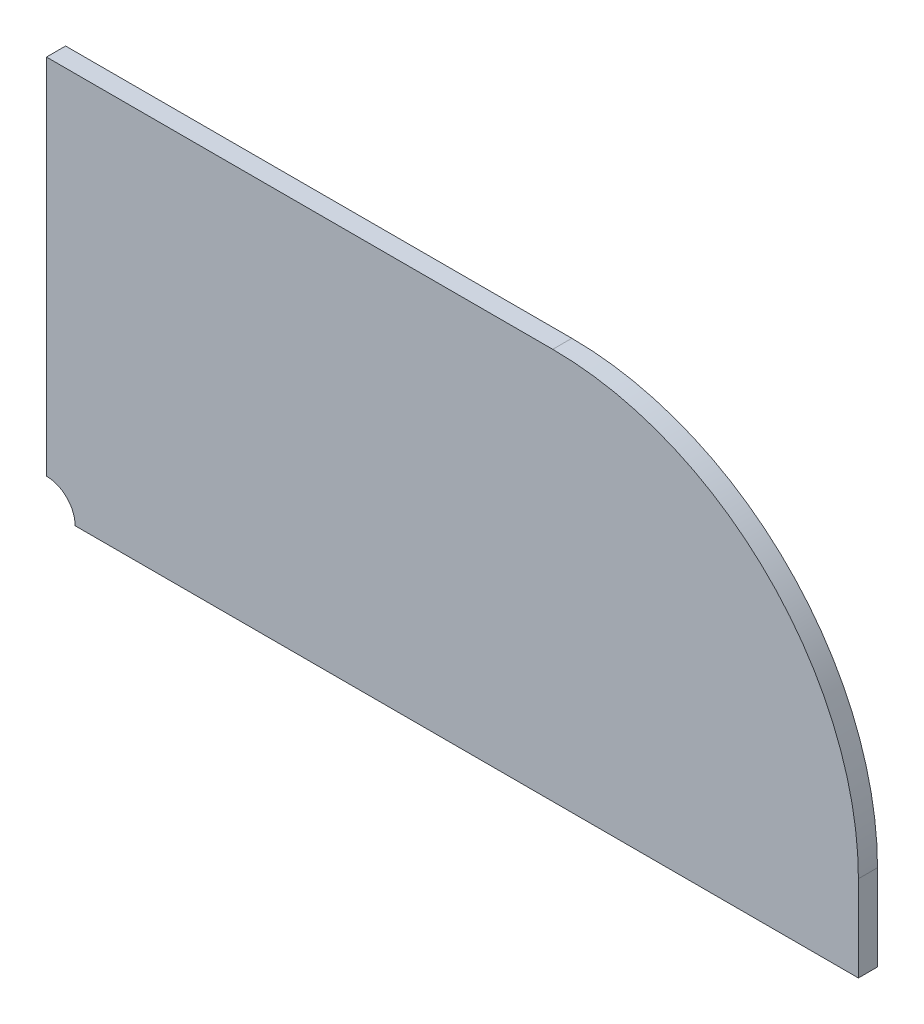
ISO-10303-21;
HEADER;
FILE_DESCRIPTION(('STEP AP214'),'2;1');
FILE_NAME('part.step','',(''),(''),'','','');
FILE_SCHEMA(('AUTOMOTIVE_DESIGN { 1 0 10303 214 1 1 1 1 }'));
ENDSEC;
DATA;
#1=APPLICATION_CONTEXT('core data for automotive mechanical design processes');
#2=APPLICATION_PROTOCOL_DEFINITION('international standard','automotive_design',2000,#1);
#3=PRODUCT_CONTEXT('',#1,'mechanical');
#4=PRODUCT('Part','Part','',(#3));
#5=PRODUCT_RELATED_PRODUCT_CATEGORY('part','',(#4));
#6=PRODUCT_DEFINITION_FORMATION('','',#4);
#7=PRODUCT_DEFINITION_CONTEXT('part definition',#1,'design');
#8=PRODUCT_DEFINITION('design','',#6,#7);
#9=PRODUCT_DEFINITION_SHAPE('','',#8);
#10=(LENGTH_UNIT() NAMED_UNIT(*) SI_UNIT(.MILLI.,.METRE.));
#11=(NAMED_UNIT(*) PLANE_ANGLE_UNIT() SI_UNIT($,.RADIAN.));
#12=(NAMED_UNIT(*) SI_UNIT($,.STERADIAN.) SOLID_ANGLE_UNIT());
#13=UNCERTAINTY_MEASURE_WITH_UNIT(LENGTH_MEASURE(1.E-05),#10,'distance_accuracy_value','');
#14=(GEOMETRIC_REPRESENTATION_CONTEXT(3) GLOBAL_UNCERTAINTY_ASSIGNED_CONTEXT((#13)) GLOBAL_UNIT_ASSIGNED_CONTEXT((#10,
#11,#12)) REPRESENTATION_CONTEXT('',''));
#15=CARTESIAN_POINT('',(0.,0.,0.));
#16=DIRECTION('',(0.,0.,1.));
#17=DIRECTION('',(1.,0.,0.));
#18=AXIS2_PLACEMENT_3D('',#15,#16,#17);
#19=CARTESIAN_POINT('',(26.5,4.5,-1.));
#20=DIRECTION('',(0.,0.,1.));
#21=DIRECTION('',(1.,0.,0.));
#22=AXIS2_PLACEMENT_3D('',#19,#20,#21);
#23=CYLINDRICAL_SURFACE('',#22,16.);
#24=CARTESIAN_POINT('',(26.5,4.5,0.));
#25=DIRECTION('',(0.,0.,1.));
#26=DIRECTION('',(1.,0.,0.));
#27=AXIS2_PLACEMENT_3D('',#24,#25,#26);
#28=CIRCLE('',#27,16.);
#29=CARTESIAN_POINT('',(42.5,4.5,0.));
#30=VERTEX_POINT('',#29);
#31=CARTESIAN_POINT('',(26.5,20.5,0.));
#32=VERTEX_POINT('',#31);
#33=EDGE_CURVE('E123',#30,#32,#28,.T.);
#34=ORIENTED_EDGE('',*,*,#33,.F.);
#35=DIRECTION('',(0.,0.,1.));
#36=VECTOR('',#35,1.);
#37=CARTESIAN_POINT('',(42.5,4.5,-1.));
#38=LINE('',#37,#36);
#39=CARTESIAN_POINT('',(42.5,4.5,-1.));
#40=VERTEX_POINT('',#39);
#41=EDGE_CURVE('E11',#40,#30,#38,.T.);
#42=ORIENTED_EDGE('',*,*,#41,.F.);
#43=CARTESIAN_POINT('',(26.5,4.5,-1.));
#44=DIRECTION('',(0.,0.,1.));
#45=DIRECTION('',(1.,0.,0.));
#46=AXIS2_PLACEMENT_3D('',#43,#44,#45);
#47=CIRCLE('',#46,16.);
#48=CARTESIAN_POINT('',(26.5,20.5,-1.));
#49=VERTEX_POINT('',#48);
#50=EDGE_CURVE('E137',#40,#49,#47,.T.);
#51=ORIENTED_EDGE('',*,*,#50,.T.);
#52=DIRECTION('',(0.,0.,1.));
#53=VECTOR('',#52,1.);
#54=CARTESIAN_POINT('',(26.5,20.5,-1.));
#55=LINE('',#54,#53);
#56=EDGE_CURVE('E41',#49,#32,#55,.T.);
#57=ORIENTED_EDGE('',*,*,#56,.T.);
#58=EDGE_LOOP('',(#34,#42,#51,#57));
#59=FACE_BOUND('',#58,.T.);
#60=ADVANCED_FACE('F38',(#59),#23,.T.);
#61=CARTESIAN_POINT('',(42.5,4.5,-1.));
#62=DIRECTION('',(1.,0.,0.));
#63=DIRECTION('',(0.,0.,-1.));
#64=AXIS2_PLACEMENT_3D('',#61,#62,#63);
#65=PLANE('',#64);
#66=DIRECTION('',(0.,1.,0.));
#67=VECTOR('',#66,1.);
#68=CARTESIAN_POINT('',(42.5,4.5,0.));
#69=LINE('',#68,#67);
#70=CARTESIAN_POINT('',(42.5,0.,0.));
#71=VERTEX_POINT('',#70);
#72=EDGE_CURVE('E135',#71,#30,#69,.T.);
#73=ORIENTED_EDGE('',*,*,#72,.F.);
#74=DIRECTION('',(0.,0.,1.));
#75=VECTOR('',#74,1.);
#76=CARTESIAN_POINT('',(42.5,0.,-1.));
#77=LINE('',#76,#75);
#78=CARTESIAN_POINT('',(42.5,0.,-1.));
#79=VERTEX_POINT('',#78);
#80=EDGE_CURVE('E47',#79,#71,#77,.T.);
#81=ORIENTED_EDGE('',*,*,#80,.F.);
#82=DIRECTION('',(0.,1.,0.));
#83=VECTOR('',#82,1.);
#84=CARTESIAN_POINT('',(42.5,4.5,-1.));
#85=LINE('',#84,#83);
#86=EDGE_CURVE('E113',#79,#40,#85,.T.);
#87=ORIENTED_EDGE('',*,*,#86,.T.);
#88=ORIENTED_EDGE('',*,*,#41,.T.);
#89=EDGE_LOOP('',(#73,#81,#87,#88));
#90=FACE_BOUND('',#89,.T.);
#91=ADVANCED_FACE('F145',(#90),#65,.T.);
#92=CARTESIAN_POINT('',(42.5,0.,-1.));
#93=DIRECTION('',(0.,-1.,0.));
#94=DIRECTION('',(1.,0.,0.));
#95=AXIS2_PLACEMENT_3D('',#92,#93,#94);
#96=PLANE('',#95);
#97=DIRECTION('',(1.,0.,0.));
#98=VECTOR('',#97,1.);
#99=CARTESIAN_POINT('',(42.5,0.,0.));
#100=LINE('',#99,#98);
#101=CARTESIAN_POINT('',(1.5,0.,0.));
#102=VERTEX_POINT('',#101);
#103=EDGE_CURVE('E100',#102,#71,#100,.T.);
#104=ORIENTED_EDGE('',*,*,#103,.F.);
#105=DIRECTION('',(0.,0.,1.));
#106=VECTOR('',#105,1.);
#107=CARTESIAN_POINT('',(1.5,0.,-1.));
#108=LINE('',#107,#106);
#109=CARTESIAN_POINT('',(1.5,0.,-1.));
#110=VERTEX_POINT('',#109);
#111=EDGE_CURVE('E95',#110,#102,#108,.T.);
#112=ORIENTED_EDGE('',*,*,#111,.F.);
#113=DIRECTION('',(1.,0.,0.));
#114=VECTOR('',#113,1.);
#115=CARTESIAN_POINT('',(42.5,0.,-1.));
#116=LINE('',#115,#114);
#117=EDGE_CURVE('E98',#110,#79,#116,.T.);
#118=ORIENTED_EDGE('',*,*,#117,.T.);
#119=ORIENTED_EDGE('',*,*,#80,.T.);
#120=EDGE_LOOP('',(#104,#112,#118,#119));
#121=FACE_BOUND('',#120,.T.);
#122=ADVANCED_FACE('F97',(#121),#96,.T.);
#123=CARTESIAN_POINT('',(0.,0.,-1.));
#124=DIRECTION('',(0.,0.,1.));
#125=DIRECTION('',(1.,0.,0.));
#126=AXIS2_PLACEMENT_3D('',#123,#124,#125);
#127=CYLINDRICAL_SURFACE('',#126,1.5);
#128=CARTESIAN_POINT('',(0.,0.,0.));
#129=DIRECTION('',(0.,0.,-1.));
#130=DIRECTION('',(1.,0.,0.));
#131=AXIS2_PLACEMENT_3D('',#128,#129,#130);
#132=CIRCLE('',#131,1.5);
#133=CARTESIAN_POINT('',(0.,1.5,0.));
#134=VERTEX_POINT('',#133);
#135=EDGE_CURVE('E132',#134,#102,#132,.T.);
#136=ORIENTED_EDGE('',*,*,#135,.F.);
#137=DIRECTION('',(0.,0.,1.));
#138=VECTOR('',#137,1.);
#139=CARTESIAN_POINT('',(0.,1.5,-1.));
#140=LINE('',#139,#138);
#141=CARTESIAN_POINT('',(0.,1.5,-1.));
#142=VERTEX_POINT('',#141);
#143=EDGE_CURVE('E105',#142,#134,#140,.T.);
#144=ORIENTED_EDGE('',*,*,#143,.F.);
#145=CARTESIAN_POINT('',(0.,0.,-1.));
#146=DIRECTION('',(0.,0.,-1.));
#147=DIRECTION('',(1.,0.,0.));
#148=AXIS2_PLACEMENT_3D('',#145,#146,#147);
#149=CIRCLE('',#148,1.5);
#150=EDGE_CURVE('E111',#142,#110,#149,.T.);
#151=ORIENTED_EDGE('',*,*,#150,.T.);
#152=ORIENTED_EDGE('',*,*,#111,.T.);
#153=EDGE_LOOP('',(#136,#144,#151,#152));
#154=FACE_BOUND('',#153,.T.);
#155=ADVANCED_FACE('F115',(#154),#127,.F.);
#156=CARTESIAN_POINT('',(0.,1.5,-1.));
#157=DIRECTION('',(-1.,0.,0.));
#158=DIRECTION('',(0.,0.,1.));
#159=AXIS2_PLACEMENT_3D('',#156,#157,#158);
#160=PLANE('',#159);
#161=DIRECTION('',(0.,-1.,0.));
#162=VECTOR('',#161,1.);
#163=CARTESIAN_POINT('',(0.,1.5,0.));
#164=LINE('',#163,#162);
#165=CARTESIAN_POINT('',(0.,20.5,0.));
#166=VERTEX_POINT('',#165);
#167=EDGE_CURVE('E129',#166,#134,#164,.T.);
#168=ORIENTED_EDGE('',*,*,#167,.F.);
#169=DIRECTION('',(0.,0.,1.));
#170=VECTOR('',#169,1.);
#171=CARTESIAN_POINT('',(0.,20.5,-1.));
#172=LINE('',#171,#170);
#173=CARTESIAN_POINT('',(0.,20.5,-1.));
#174=VERTEX_POINT('',#173);
#175=EDGE_CURVE('E140',#174,#166,#172,.T.);
#176=ORIENTED_EDGE('',*,*,#175,.F.);
#177=DIRECTION('',(0.,-1.,0.));
#178=VECTOR('',#177,1.);
#179=CARTESIAN_POINT('',(0.,1.5,-1.));
#180=LINE('',#179,#178);
#181=EDGE_CURVE('E116',#174,#142,#180,.T.);
#182=ORIENTED_EDGE('',*,*,#181,.T.);
#183=ORIENTED_EDGE('',*,*,#143,.T.);
#184=EDGE_LOOP('',(#168,#176,#182,#183));
#185=FACE_BOUND('',#184,.T.);
#186=ADVANCED_FACE('F158',(#185),#160,.T.);
#187=CARTESIAN_POINT('',(0.,20.5,-1.));
#188=DIRECTION('',(0.,1.,0.));
#189=DIRECTION('',(0.,0.,1.));
#190=AXIS2_PLACEMENT_3D('',#187,#188,#189);
#191=PLANE('',#190);
#192=DIRECTION('',(-1.,0.,0.));
#193=VECTOR('',#192,1.);
#194=CARTESIAN_POINT('',(0.,20.5,0.));
#195=LINE('',#194,#193);
#196=EDGE_CURVE('E126',#32,#166,#195,.T.);
#197=ORIENTED_EDGE('',*,*,#196,.F.);
#198=ORIENTED_EDGE('',*,*,#56,.F.);
#199=DIRECTION('',(-1.,0.,0.));
#200=VECTOR('',#199,1.);
#201=CARTESIAN_POINT('',(0.,20.5,-1.));
#202=LINE('',#201,#200);
#203=EDGE_CURVE('E118',#49,#174,#202,.T.);
#204=ORIENTED_EDGE('',*,*,#203,.T.);
#205=ORIENTED_EDGE('',*,*,#175,.T.);
#206=EDGE_LOOP('',(#197,#198,#204,#205));
#207=FACE_BOUND('',#206,.T.);
#208=ADVANCED_FACE('F142',(#207),#191,.T.);
#209=CARTESIAN_POINT('',(26.5,4.5,-1.));
#210=DIRECTION('',(0.,0.,1.));
#211=DIRECTION('',(1.,0.,0.));
#212=AXIS2_PLACEMENT_3D('',#209,#210,#211);
#213=PLANE('',#212);
#214=ORIENTED_EDGE('',*,*,#50,.F.);
#215=ORIENTED_EDGE('',*,*,#86,.F.);
#216=ORIENTED_EDGE('',*,*,#117,.F.);
#217=ORIENTED_EDGE('',*,*,#150,.F.);
#218=ORIENTED_EDGE('',*,*,#181,.F.);
#219=ORIENTED_EDGE('',*,*,#203,.F.);
#220=EDGE_LOOP('',(#214,#215,#216,#217,#218,#219));
#221=FACE_BOUND('',#220,.T.);
#222=ADVANCED_FACE('F109',(#221),#213,.F.);
#223=CARTESIAN_POINT('',(26.5,4.5,0.));
#224=DIRECTION('',(0.,0.,1.));
#225=DIRECTION('',(1.,0.,0.));
#226=AXIS2_PLACEMENT_3D('',#223,#224,#225);
#227=PLANE('',#226);
#228=ORIENTED_EDGE('',*,*,#33,.T.);
#229=ORIENTED_EDGE('',*,*,#196,.T.);
#230=ORIENTED_EDGE('',*,*,#167,.T.);
#231=ORIENTED_EDGE('',*,*,#135,.T.);
#232=ORIENTED_EDGE('',*,*,#103,.T.);
#233=ORIENTED_EDGE('',*,*,#72,.T.);
#234=EDGE_LOOP('',(#228,#229,#230,#231,#232,#233));
#235=FACE_BOUND('',#234,.T.);
#236=ADVANCED_FACE('F144',(#235),#227,.T.);
#237=CLOSED_SHELL('',(#60,#91,#122,#155,#186,#208,#222,#236));
#238=MANIFOLD_SOLID_BREP('B2',#237);
#239=ADVANCED_BREP_SHAPE_REPRESENTATION('',(#18,#238),#14);
#240=SHAPE_DEFINITION_REPRESENTATION(#9,#239);
ENDSEC;
END-ISO-10303-21;
